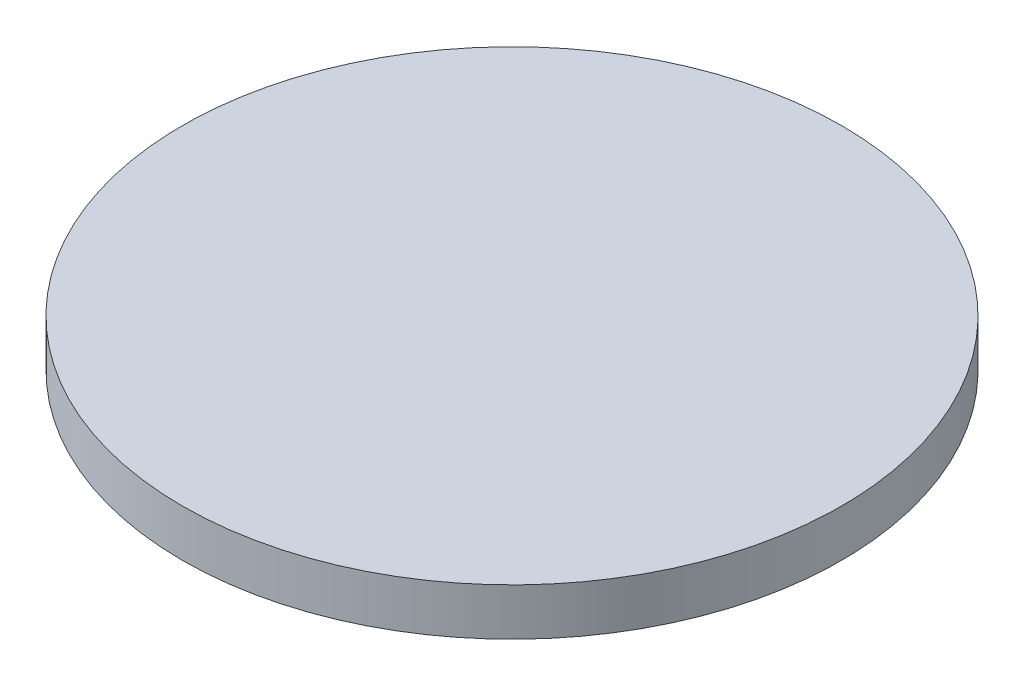
ISO-10303-21;
HEADER;
FILE_DESCRIPTION(('STEP AP214'),'2;1');
FILE_NAME('part.step','',(''),(''),'','','');
FILE_SCHEMA(('AUTOMOTIVE_DESIGN { 1 0 10303 214 1 1 1 1 }'));
ENDSEC;
DATA;
#1=APPLICATION_CONTEXT('core data for automotive mechanical design processes');
#2=APPLICATION_PROTOCOL_DEFINITION('international standard','automotive_design',2000,#1);
#3=PRODUCT_CONTEXT('',#1,'mechanical');
#4=PRODUCT('Part','Part','',(#3));
#5=PRODUCT_RELATED_PRODUCT_CATEGORY('part','',(#4));
#6=PRODUCT_DEFINITION_FORMATION('','',#4);
#7=PRODUCT_DEFINITION_CONTEXT('part definition',#1,'design');
#8=PRODUCT_DEFINITION('design','',#6,#7);
#9=PRODUCT_DEFINITION_SHAPE('','',#8);
#10=(LENGTH_UNIT() NAMED_UNIT(*) SI_UNIT(.MILLI.,.METRE.));
#11=(NAMED_UNIT(*) PLANE_ANGLE_UNIT() SI_UNIT($,.RADIAN.));
#12=(NAMED_UNIT(*) SI_UNIT($,.STERADIAN.) SOLID_ANGLE_UNIT());
#13=UNCERTAINTY_MEASURE_WITH_UNIT(LENGTH_MEASURE(1.E-05),#10,'distance_accuracy_value','');
#14=(GEOMETRIC_REPRESENTATION_CONTEXT(3) GLOBAL_UNCERTAINTY_ASSIGNED_CONTEXT((#13)) GLOBAL_UNIT_ASSIGNED_CONTEXT((#10,
#11,#12)) REPRESENTATION_CONTEXT('',''));
#15=CARTESIAN_POINT('',(0.,0.,0.));
#16=DIRECTION('',(0.,0.,1.));
#17=DIRECTION('',(1.,0.,0.));
#18=AXIS2_PLACEMENT_3D('',#15,#16,#17);
#19=CARTESIAN_POINT('',(0.,3.175,0.));
#20=DIRECTION('',(0.,-1.,0.));
#21=DIRECTION('',(0.,0.,-1.));
#22=AXIS2_PLACEMENT_3D('',#19,#20,#21);
#23=CYLINDRICAL_SURFACE('',#22,22.225);
#24=CARTESIAN_POINT('',(0.,3.175,0.));
#25=DIRECTION('',(0.,1.,0.));
#26=DIRECTION('',(0.,0.,1.));
#27=AXIS2_PLACEMENT_3D('',#24,#25,#26);
#28=CIRCLE('',#27,22.225);
#29=CARTESIAN_POINT('',(0.,3.175,22.225));
#30=VERTEX_POINT('',#29);
#31=EDGE_CURVE('E10',#30,#30,#28,.T.);
#32=ORIENTED_EDGE('',*,*,#31,.F.);
#33=EDGE_LOOP('',(#32));
#34=FACE_BOUND('',#33,.T.);
#35=CARTESIAN_POINT('',(0.,0.,0.));
#36=DIRECTION('',(0.,1.,0.));
#37=DIRECTION('',(0.,0.,1.));
#38=AXIS2_PLACEMENT_3D('',#35,#36,#37);
#39=CIRCLE('',#38,22.225);
#40=CARTESIAN_POINT('',(0.,0.,22.225));
#41=VERTEX_POINT('',#40);
#42=EDGE_CURVE('E34',#41,#41,#39,.T.);
#43=ORIENTED_EDGE('',*,*,#42,.T.);
#44=EDGE_LOOP('',(#43));
#45=FACE_BOUND('',#44,.T.);
#46=ADVANCED_FACE('F31',(#34,#45),#23,.T.);
#47=CARTESIAN_POINT('',(0.,3.175,0.));
#48=DIRECTION('',(0.,1.,0.));
#49=DIRECTION('',(0.,0.,1.));
#50=AXIS2_PLACEMENT_3D('',#47,#48,#49);
#51=PLANE('',#50);
#52=ORIENTED_EDGE('',*,*,#31,.T.);
#53=EDGE_LOOP('',(#52));
#54=FACE_BOUND('',#53,.T.);
#55=ADVANCED_FACE('F46',(#54),#51,.T.);
#56=CARTESIAN_POINT('',(0.,0.,0.));
#57=DIRECTION('',(0.,1.,0.));
#58=DIRECTION('',(0.,0.,1.));
#59=AXIS2_PLACEMENT_3D('',#56,#57,#58);
#60=PLANE('',#59);
#61=ORIENTED_EDGE('',*,*,#42,.F.);
#62=EDGE_LOOP('',(#61));
#63=FACE_BOUND('',#62,.T.);
#64=ADVANCED_FACE('F44',(#63),#60,.F.);
#65=CLOSED_SHELL('',(#46,#55,#64));
#66=MANIFOLD_SOLID_BREP('B2',#65);
#67=ADVANCED_BREP_SHAPE_REPRESENTATION('',(#18,#66),#14);
#68=SHAPE_DEFINITION_REPRESENTATION(#9,#67);
ENDSEC;
END-ISO-10303-21;
